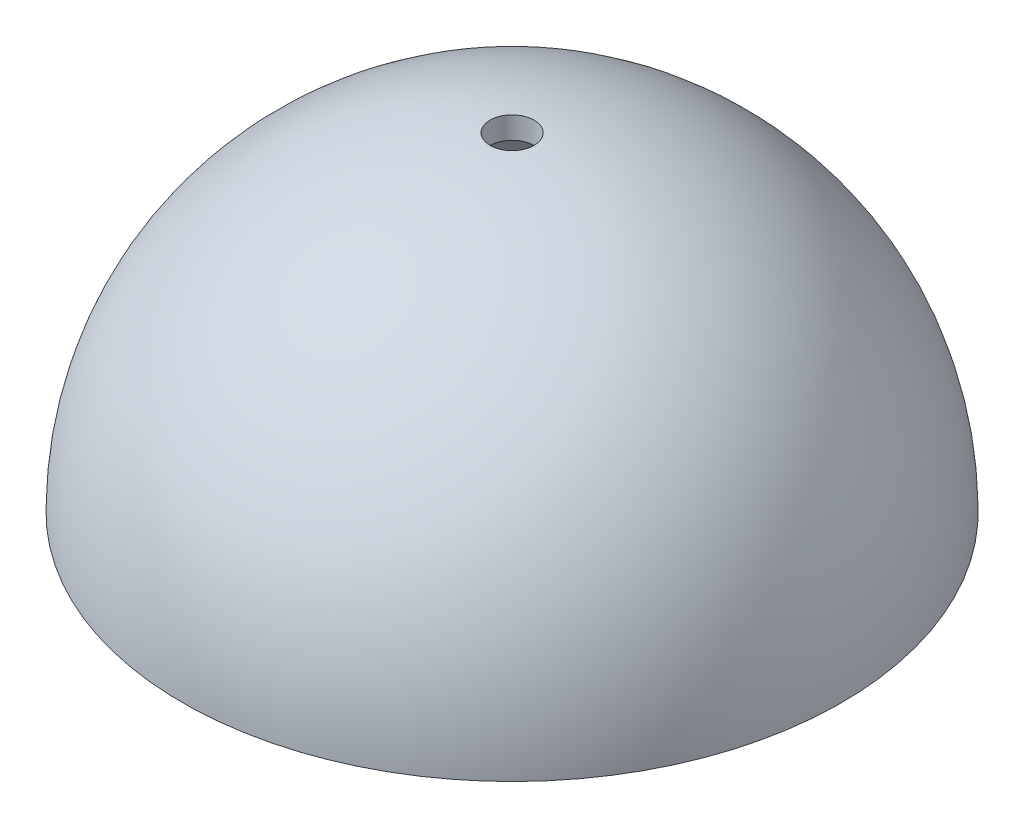
ISO-10303-21;
HEADER;
FILE_DESCRIPTION(('STEP AP214'),'2;1');
FILE_NAME('part.step','',(''),(''),'','','');
FILE_SCHEMA(('AUTOMOTIVE_DESIGN { 1 0 10303 214 1 1 1 1 }'));
ENDSEC;
DATA;
#1=APPLICATION_CONTEXT('core data for automotive mechanical design processes');
#2=APPLICATION_PROTOCOL_DEFINITION('international standard','automotive_design',2000,#1);
#3=PRODUCT_CONTEXT('',#1,'mechanical');
#4=PRODUCT('Part','Part','',(#3));
#5=PRODUCT_RELATED_PRODUCT_CATEGORY('part','',(#4));
#6=PRODUCT_DEFINITION_FORMATION('','',#4);
#7=PRODUCT_DEFINITION_CONTEXT('part definition',#1,'design');
#8=PRODUCT_DEFINITION('design','',#6,#7);
#9=PRODUCT_DEFINITION_SHAPE('','',#8);
#10=(LENGTH_UNIT() NAMED_UNIT(*) SI_UNIT(.MILLI.,.METRE.));
#11=(NAMED_UNIT(*) PLANE_ANGLE_UNIT() SI_UNIT($,.RADIAN.));
#12=(NAMED_UNIT(*) SI_UNIT($,.STERADIAN.) SOLID_ANGLE_UNIT());
#13=UNCERTAINTY_MEASURE_WITH_UNIT(LENGTH_MEASURE(1.E-05),#10,'distance_accuracy_value','');
#14=(GEOMETRIC_REPRESENTATION_CONTEXT(3) GLOBAL_UNCERTAINTY_ASSIGNED_CONTEXT((#13)) GLOBAL_UNIT_ASSIGNED_CONTEXT((#10,
#11,#12)) REPRESENTATION_CONTEXT('',''));
#15=CARTESIAN_POINT('',(0.,0.,0.));
#16=DIRECTION('',(0.,0.,1.));
#17=DIRECTION('',(1.,0.,0.));
#18=AXIS2_PLACEMENT_3D('',#15,#16,#17);
#19=CARTESIAN_POINT('',(0.,0.,0.));
#20=DIRECTION('',(0.,1.,0.));
#21=DIRECTION('',(0.,0.,1.));
#22=AXIS2_PLACEMENT_3D('',#19,#20,#21);
#23=PLANE('',#22);
#24=CARTESIAN_POINT('',(0.,0.,0.));
#25=DIRECTION('',(0.,1.,0.));
#26=DIRECTION('',(0.,0.,1.));
#27=AXIS2_PLACEMENT_3D('',#24,#25,#26);
#28=CIRCLE('',#27,140.);
#29=CARTESIAN_POINT('',(0.,0.,140.));
#30=VERTEX_POINT('',#29);
#31=EDGE_CURVE('E38',#30,#30,#28,.F.);
#32=ORIENTED_EDGE('',*,*,#31,.F.);
#33=EDGE_LOOP('',(#32));
#34=FACE_BOUND('',#33,.T.);
#35=CARTESIAN_POINT('',(0.,0.,0.));
#36=DIRECTION('',(0.,-1.,0.));
#37=DIRECTION('',(0.,0.,-1.));
#38=AXIS2_PLACEMENT_3D('',#35,#36,#37);
#39=CIRCLE('',#38,150.);
#40=CARTESIAN_POINT('',(0.,0.,-150.));
#41=VERTEX_POINT('',#40);
#42=EDGE_CURVE('E10',#41,#41,#39,.T.);
#43=ORIENTED_EDGE('',*,*,#42,.T.);
#44=EDGE_LOOP('',(#43));
#45=FACE_BOUND('',#44,.T.);
#46=ADVANCED_FACE('F31',(#34,#45),#23,.F.);
#47=CARTESIAN_POINT('',(0.,0.,0.));
#48=DIRECTION('',(0.,-1.,0.));
#49=DIRECTION('',(-1.,0.,0.));
#50=AXIS2_PLACEMENT_3D('',#47,#48,#49);
#51=SPHERICAL_SURFACE('',#50,150.);
#52=CARTESIAN_POINT('',(0.,149.666295470958,0.));
#53=DIRECTION('',(0.,-1.,0.));
#54=DIRECTION('',(0.,0.,-1.));
#55=AXIS2_PLACEMENT_3D('',#52,#53,#54);
#56=CIRCLE('',#55,10.);
#57=CARTESIAN_POINT('',(0.,149.666295470958,10.));
#58=VERTEX_POINT('',#57);
#59=EDGE_CURVE('E42',#58,#58,#56,.T.);
#60=ORIENTED_EDGE('',*,*,#59,.T.);
#61=EDGE_LOOP('',(#60));
#62=FACE_BOUND('',#61,.T.);
#63=ORIENTED_EDGE('',*,*,#42,.F.);
#64=EDGE_LOOP('',(#63));
#65=FACE_BOUND('',#64,.T.);
#66=ADVANCED_FACE('F57',(#62,#65),#51,.T.);
#67=CARTESIAN_POINT('',(0.,0.,0.));
#68=DIRECTION('',(0.,-1.,0.));
#69=DIRECTION('',(-1.,0.,0.));
#70=AXIS2_PLACEMENT_3D('',#67,#68,#69);
#71=SPHERICAL_SURFACE('',#70,140.);
#72=CARTESIAN_POINT('',(0.,139.642400437689,0.));
#73=DIRECTION('',(0.,-1.,0.));
#74=DIRECTION('',(0.,0.,-1.));
#75=AXIS2_PLACEMENT_3D('',#72,#73,#74);
#76=CIRCLE('',#75,10.);
#77=CARTESIAN_POINT('',(0.,139.642400437689,10.));
#78=VERTEX_POINT('',#77);
#79=EDGE_CURVE('E34',#78,#78,#76,.T.);
#80=ORIENTED_EDGE('',*,*,#79,.F.);
#81=EDGE_LOOP('',(#80));
#82=FACE_BOUND('',#81,.T.);
#83=ORIENTED_EDGE('',*,*,#31,.T.);
#84=EDGE_LOOP('',(#83));
#85=FACE_BOUND('',#84,.T.);
#86=ADVANCED_FACE('F54',(#82,#85),#71,.F.);
#87=CARTESIAN_POINT('',(0.,-1.2E-05,0.));
#88=DIRECTION('',(0.,1.,0.));
#89=DIRECTION('',(0.,0.,1.));
#90=AXIS2_PLACEMENT_3D('',#87,#88,#89);
#91=CYLINDRICAL_SURFACE('',#90,10.);
#92=CARTESIAN_POINT('',(0.,139.642400437689,10.));
#93=CARTESIAN_POINT('',(0.,139.746816010953,10.));
#94=CARTESIAN_POINT('',(0.,139.851231584216,10.));
#95=CARTESIAN_POINT('',(0.,140.060062730742,10.));
#96=CARTESIAN_POINT('',(0.,140.164478304005,10.));
#97=CARTESIAN_POINT('',(0.,140.373309450532,10.));
#98=CARTESIAN_POINT('',(0.,140.477725023795,10.));
#99=CARTESIAN_POINT('',(0.,140.686556170321,10.));
#100=CARTESIAN_POINT('',(0.,140.790971743585,10.));
#101=CARTESIAN_POINT('',(0.,140.999802890111,10.));
#102=CARTESIAN_POINT('',(0.,141.104218463374,10.));
#103=CARTESIAN_POINT('',(0.,141.313049609901,10.));
#104=CARTESIAN_POINT('',(0.,141.417465183164,10.));
#105=CARTESIAN_POINT('',(0.,141.62629632969,10.));
#106=CARTESIAN_POINT('',(0.,141.730711902954,10.));
#107=CARTESIAN_POINT('',(0.,141.93954304948,10.));
#108=CARTESIAN_POINT('',(0.,142.043958622743,10.));
#109=CARTESIAN_POINT('',(0.,142.25278976927,10.));
#110=CARTESIAN_POINT('',(0.,142.357205342533,10.));
#111=CARTESIAN_POINT('',(0.,142.566036489059,10.));
#112=CARTESIAN_POINT('',(0.,142.670452062322,10.));
#113=CARTESIAN_POINT('',(0.,142.879283208849,10.));
#114=CARTESIAN_POINT('',(0.,142.983698782112,10.));
#115=CARTESIAN_POINT('',(0.,143.192529928639,10.));
#116=CARTESIAN_POINT('',(0.,143.296945501902,10.));
#117=CARTESIAN_POINT('',(0.,143.505776648428,10.));
#118=CARTESIAN_POINT('',(0.,143.610192221691,10.));
#119=CARTESIAN_POINT('',(0.,143.819023368218,10.));
#120=CARTESIAN_POINT('',(0.,143.923438941481,10.));
#121=CARTESIAN_POINT('',(0.,144.132270088007,10.));
#122=CARTESIAN_POINT('',(0.,144.236685661271,10.));
#123=CARTESIAN_POINT('',(0.,144.445516807797,10.));
#124=CARTESIAN_POINT('',(0.,144.54993238106,10.));
#125=CARTESIAN_POINT('',(0.,144.758763527587,10.));
#126=CARTESIAN_POINT('',(0.,144.86317910085,10.));
#127=CARTESIAN_POINT('',(0.,145.072010247376,10.));
#128=CARTESIAN_POINT('',(0.,145.17642582064,10.));
#129=CARTESIAN_POINT('',(0.,145.385256967166,10.));
#130=CARTESIAN_POINT('',(0.,145.489672540429,10.));
#131=CARTESIAN_POINT('',(0.,145.698503686956,10.));
#132=CARTESIAN_POINT('',(0.,145.802919260219,10.));
#133=CARTESIAN_POINT('',(0.,146.011750406745,10.));
#134=CARTESIAN_POINT('',(0.,146.116165980008,10.));
#135=CARTESIAN_POINT('',(0.,146.324997126535,10.));
#136=CARTESIAN_POINT('',(0.,146.429412699798,10.));
#137=CARTESIAN_POINT('',(0.,146.638243846324,10.));
#138=CARTESIAN_POINT('',(0.,146.742659419588,10.));
#139=CARTESIAN_POINT('',(0.,146.951490566114,10.));
#140=CARTESIAN_POINT('',(0.,147.055906139377,10.));
#141=CARTESIAN_POINT('',(0.,147.264737285904,10.));
#142=CARTESIAN_POINT('',(0.,147.369152859167,10.));
#143=CARTESIAN_POINT('',(0.,147.577984005693,10.));
#144=CARTESIAN_POINT('',(0.,147.682399578957,10.));
#145=CARTESIAN_POINT('',(0.,147.891230725483,10.));
#146=CARTESIAN_POINT('',(0.,147.995646298746,10.));
#147=CARTESIAN_POINT('',(0.,148.204477445273,10.));
#148=CARTESIAN_POINT('',(0.,148.308893018536,10.));
#149=CARTESIAN_POINT('',(0.,148.517724165062,10.));
#150=CARTESIAN_POINT('',(0.,148.622139738325,10.));
#151=CARTESIAN_POINT('',(0.,148.830970884852,10.));
#152=CARTESIAN_POINT('',(0.,148.935386458115,10.));
#153=CARTESIAN_POINT('',(0.,149.144217604642,10.));
#154=CARTESIAN_POINT('',(0.,149.248633177905,10.));
#155=CARTESIAN_POINT('',(0.,149.457464324431,10.));
#156=CARTESIAN_POINT('',(0.,149.561879897694,10.));
#157=CARTESIAN_POINT('',(0.,149.666295470958,10.));
#158=B_SPLINE_CURVE_WITH_KNOTS('',3,(#92,#93,#94,#95,#96,#97,#98,#99,#100,#101,#102,#103,#104,
#105,#106,#107,#108,#109,#110,#111,#112,#113,#114,#115,#116,#117,#118,#119,#120,#121,#122,#123,
#124,#125,#126,#127,#128,#129,#130,#131,#132,#133,#134,#135,#136,#137,#138,#139,#140,#141,#142,
#143,#144,#145,#146,#147,#148,#149,#150,#151,#152,#153,#154,#155,#156,#157),.UNSPECIFIED.,.F.,
.F.,(4,2,2,2,2,2,2,2,2,2,2,2,2,2,2,2,2,2,2,2,2,2,2,2,2,2,2,2,2,2,2,2,4),(0.,0.313246719789634,
0.626493439579268,0.939740159368901,1.25298687915854,1.56623359894817,1.8794803187378,
2.19272703852744,2.50597375831707,2.81922047810668,3.13246719789631,3.44571391768594,
3.75896063747558,4.07220735726521,4.38545407705485,4.69870079684448,5.01194751663411,
5.32519423642375,5.63844095621338,5.95168767600302,6.26493439579265,6.57818111558228,
6.89142783537192,7.20467455516155,7.51792127495116,7.83116799474079,8.14441471453042,
8.45766143432006,8.77090815410969,9.08415487389932,9.39740159368896,9.71064831347859,
10.0238950332682),.UNSPECIFIED.);
#159=EDGE_CURVE('BSEAM51',#78,#58,#158,.T.);
#160=ORIENTED_EDGE('',*,*,#79,.T.);
#161=ORIENTED_EDGE('',*,*,#59,.F.);
#162=ORIENTED_EDGE('',*,*,#159,.T.);
#163=ORIENTED_EDGE('',*,*,#159,.F.);
#164=EDGE_LOOP('',(#160,#162,#161,#163));
#165=FACE_BOUND('',#164,.T.);
#166=ADVANCED_FACE('F51',(#165),#91,.F.);
#167=CLOSED_SHELL('',(#46,#66,#86,#166));
#168=MANIFOLD_SOLID_BREP('B2',#167);
#169=ADVANCED_BREP_SHAPE_REPRESENTATION('',(#18,#168),#14);
#170=SHAPE_DEFINITION_REPRESENTATION(#9,#169);
ENDSEC;
END-ISO-10303-21;
